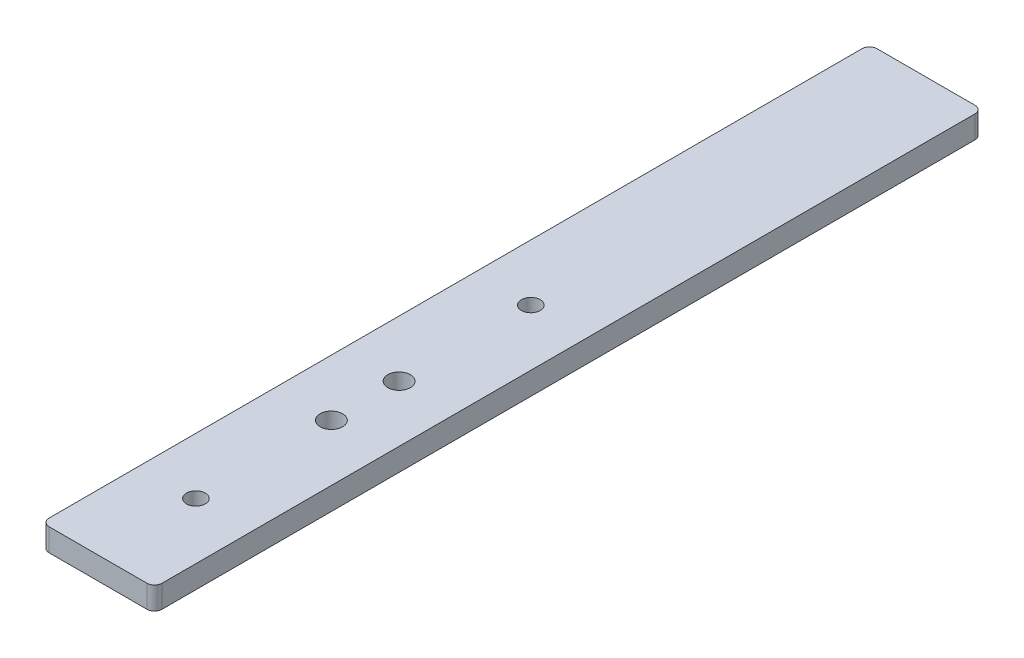
ISO-10303-21;
HEADER;
FILE_DESCRIPTION(('STEP AP214'),'2;1');
FILE_NAME('part.step','',(''),(''),'','','');
FILE_SCHEMA(('AUTOMOTIVE_DESIGN { 1 0 10303 214 1 1 1 1 }'));
ENDSEC;
DATA;
#1=APPLICATION_CONTEXT('core data for automotive mechanical design processes');
#2=APPLICATION_PROTOCOL_DEFINITION('international standard','automotive_design',2000,#1);
#3=PRODUCT_CONTEXT('',#1,'mechanical');
#4=PRODUCT('Part','Part','',(#3));
#5=PRODUCT_RELATED_PRODUCT_CATEGORY('part','',(#4));
#6=PRODUCT_DEFINITION_FORMATION('','',#4);
#7=PRODUCT_DEFINITION_CONTEXT('part definition',#1,'design');
#8=PRODUCT_DEFINITION('design','',#6,#7);
#9=PRODUCT_DEFINITION_SHAPE('','',#8);
#10=(LENGTH_UNIT() NAMED_UNIT(*) SI_UNIT(.MILLI.,.METRE.));
#11=(NAMED_UNIT(*) PLANE_ANGLE_UNIT() SI_UNIT($,.RADIAN.));
#12=(NAMED_UNIT(*) SI_UNIT($,.STERADIAN.) SOLID_ANGLE_UNIT());
#13=UNCERTAINTY_MEASURE_WITH_UNIT(LENGTH_MEASURE(1.E-05),#10,'distance_accuracy_value','');
#14=(GEOMETRIC_REPRESENTATION_CONTEXT(3) GLOBAL_UNCERTAINTY_ASSIGNED_CONTEXT((#13)) GLOBAL_UNIT_ASSIGNED_CONTEXT((#10,
#11,#12)) REPRESENTATION_CONTEXT('',''));
#15=CARTESIAN_POINT('',(0.,0.,0.));
#16=DIRECTION('',(0.,0.,1.));
#17=DIRECTION('',(1.,0.,0.));
#18=AXIS2_PLACEMENT_3D('',#15,#16,#17);
#19=CARTESIAN_POINT('',(0.,3.,0.));
#20=DIRECTION('',(1.,0.,0.));
#21=DIRECTION('',(0.,0.,-1.));
#22=AXIS2_PLACEMENT_3D('',#19,#20,#21);
#23=PLANE('',#22);
#24=DIRECTION('',(0.,0.,1.));
#25=VECTOR('',#24,1.);
#26=CARTESIAN_POINT('',(0.,3.,0.));
#27=LINE('',#26,#25);
#28=CARTESIAN_POINT('',(0.,3.,-109.));
#29=VERTEX_POINT('',#28);
#30=CARTESIAN_POINT('',(0.,3.,-1.));
#31=VERTEX_POINT('',#30);
#32=EDGE_CURVE('E127',#29,#31,#27,.T.);
#33=ORIENTED_EDGE('',*,*,#32,.F.);
#34=DIRECTION('',(0.,-1.,0.));
#35=VECTOR('',#34,1.);
#36=CARTESIAN_POINT('',(0.,3.,-109.));
#37=LINE('',#36,#35);
#38=CARTESIAN_POINT('',(0.,0.,-109.));
#39=VERTEX_POINT('',#38);
#40=EDGE_CURVE('E153',#29,#39,#37,.T.);
#41=ORIENTED_EDGE('',*,*,#40,.T.);
#42=DIRECTION('',(0.,0.,1.));
#43=VECTOR('',#42,1.);
#44=CARTESIAN_POINT('',(0.,0.,0.));
#45=LINE('',#44,#43);
#46=CARTESIAN_POINT('',(0.,0.,-1.));
#47=VERTEX_POINT('',#46);
#48=EDGE_CURVE('E175',#39,#47,#45,.T.);
#49=ORIENTED_EDGE('',*,*,#48,.T.);
#50=DIRECTION('',(0.,-1.,0.));
#51=VECTOR('',#50,1.);
#52=CARTESIAN_POINT('',(0.,3.,-1.));
#53=LINE('',#52,#51);
#54=EDGE_CURVE('E151',#47,#31,#53,.F.);
#55=ORIENTED_EDGE('',*,*,#54,.T.);
#56=EDGE_LOOP('',(#33,#41,#49,#55));
#57=FACE_BOUND('',#56,.T.);
#58=ADVANCED_FACE('F34',(#57),#23,.F.);
#59=CARTESIAN_POINT('',(0.,3.,0.));
#60=DIRECTION('',(0.,0.,-1.));
#61=DIRECTION('',(-1.,0.,0.));
#62=AXIS2_PLACEMENT_3D('',#59,#60,#61);
#63=PLANE('',#62);
#64=DIRECTION('',(1.,0.,0.));
#65=VECTOR('',#64,1.);
#66=CARTESIAN_POINT('',(0.,0.,0.));
#67=LINE('',#66,#65);
#68=CARTESIAN_POINT('',(1.,0.,0.));
#69=VERTEX_POINT('',#68);
#70=CARTESIAN_POINT('',(14.,0.,0.));
#71=VERTEX_POINT('',#70);
#72=EDGE_CURVE('E132',#69,#71,#67,.T.);
#73=ORIENTED_EDGE('',*,*,#72,.T.);
#74=DIRECTION('',(0.,-1.,0.));
#75=VECTOR('',#74,1.);
#76=CARTESIAN_POINT('',(14.,3.,0.));
#77=LINE('',#76,#75);
#78=CARTESIAN_POINT('',(14.,3.,0.));
#79=VERTEX_POINT('',#78);
#80=EDGE_CURVE('E11',#71,#79,#77,.F.);
#81=ORIENTED_EDGE('',*,*,#80,.T.);
#82=DIRECTION('',(1.,0.,0.));
#83=VECTOR('',#82,1.);
#84=CARTESIAN_POINT('',(0.,3.,0.));
#85=LINE('',#84,#83);
#86=CARTESIAN_POINT('',(1.,3.,0.));
#87=VERTEX_POINT('',#86);
#88=EDGE_CURVE('E130',#87,#79,#85,.T.);
#89=ORIENTED_EDGE('',*,*,#88,.F.);
#90=DIRECTION('',(0.,-1.,0.));
#91=VECTOR('',#90,1.);
#92=CARTESIAN_POINT('',(1.,3.,0.));
#93=LINE('',#92,#91);
#94=EDGE_CURVE('E43',#87,#69,#93,.T.);
#95=ORIENTED_EDGE('',*,*,#94,.T.);
#96=EDGE_LOOP('',(#73,#81,#89,#95));
#97=FACE_BOUND('',#96,.T.);
#98=ADVANCED_FACE('F191',(#97),#63,.F.);
#99=CARTESIAN_POINT('',(15.,3.,0.));
#100=DIRECTION('',(-1.,0.,0.));
#101=DIRECTION('',(0.,0.,1.));
#102=AXIS2_PLACEMENT_3D('',#99,#100,#101);
#103=PLANE('',#102);
#104=DIRECTION('',(0.,0.,-1.));
#105=VECTOR('',#104,1.);
#106=CARTESIAN_POINT('',(15.,0.,0.));
#107=LINE('',#106,#105);
#108=CARTESIAN_POINT('',(15.,0.,-1.));
#109=VERTEX_POINT('',#108);
#110=CARTESIAN_POINT('',(15.,0.,-109.));
#111=VERTEX_POINT('',#110);
#112=EDGE_CURVE('E128',#109,#111,#107,.T.);
#113=ORIENTED_EDGE('',*,*,#112,.T.);
#114=DIRECTION('',(0.,-1.,0.));
#115=VECTOR('',#114,1.);
#116=CARTESIAN_POINT('',(15.,3.,-109.));
#117=LINE('',#116,#115);
#118=CARTESIAN_POINT('',(15.,3.,-109.));
#119=VERTEX_POINT('',#118);
#120=EDGE_CURVE('E106',#111,#119,#117,.F.);
#121=ORIENTED_EDGE('',*,*,#120,.T.);
#122=DIRECTION('',(0.,0.,-1.));
#123=VECTOR('',#122,1.);
#124=CARTESIAN_POINT('',(15.,3.,0.));
#125=LINE('',#124,#123);
#126=CARTESIAN_POINT('',(15.,3.,-1.));
#127=VERTEX_POINT('',#126);
#128=EDGE_CURVE('E185',#127,#119,#125,.T.);
#129=ORIENTED_EDGE('',*,*,#128,.F.);
#130=DIRECTION('',(0.,-1.,0.));
#131=VECTOR('',#130,1.);
#132=CARTESIAN_POINT('',(15.,3.,-1.));
#133=LINE('',#132,#131);
#134=EDGE_CURVE('E111',#127,#109,#133,.T.);
#135=ORIENTED_EDGE('',*,*,#134,.T.);
#136=EDGE_LOOP('',(#113,#121,#129,#135));
#137=FACE_BOUND('',#136,.T.);
#138=ADVANCED_FACE('F200',(#137),#103,.F.);
#139=CARTESIAN_POINT('',(0.,3.,-110.));
#140=DIRECTION('',(0.,0.,1.));
#141=DIRECTION('',(1.,0.,0.));
#142=AXIS2_PLACEMENT_3D('',#139,#140,#141);
#143=PLANE('',#142);
#144=DIRECTION('',(-1.,0.,0.));
#145=VECTOR('',#144,1.);
#146=CARTESIAN_POINT('',(0.,3.,-110.));
#147=LINE('',#146,#145);
#148=CARTESIAN_POINT('',(14.,3.,-110.));
#149=VERTEX_POINT('',#148);
#150=CARTESIAN_POINT('',(1.,3.,-110.));
#151=VERTEX_POINT('',#150);
#152=EDGE_CURVE('E121',#149,#151,#147,.T.);
#153=ORIENTED_EDGE('',*,*,#152,.F.);
#154=DIRECTION('',(0.,-1.,0.));
#155=VECTOR('',#154,1.);
#156=CARTESIAN_POINT('',(14.,3.,-110.));
#157=LINE('',#156,#155);
#158=CARTESIAN_POINT('',(14.,0.,-110.));
#159=VERTEX_POINT('',#158);
#160=EDGE_CURVE('E105',#149,#159,#157,.T.);
#161=ORIENTED_EDGE('',*,*,#160,.T.);
#162=DIRECTION('',(-1.,0.,0.));
#163=VECTOR('',#162,1.);
#164=CARTESIAN_POINT('',(0.,0.,-110.));
#165=LINE('',#164,#163);
#166=CARTESIAN_POINT('',(1.,0.,-110.));
#167=VERTEX_POINT('',#166);
#168=EDGE_CURVE('E118',#159,#167,#165,.T.);
#169=ORIENTED_EDGE('',*,*,#168,.T.);
#170=DIRECTION('',(0.,-1.,0.));
#171=VECTOR('',#170,1.);
#172=CARTESIAN_POINT('',(1.,3.,-110.));
#173=LINE('',#172,#171);
#174=EDGE_CURVE('E123',#167,#151,#173,.F.);
#175=ORIENTED_EDGE('',*,*,#174,.T.);
#176=EDGE_LOOP('',(#153,#161,#169,#175));
#177=FACE_BOUND('',#176,.T.);
#178=ADVANCED_FACE('F117',(#177),#143,.F.);
#179=CARTESIAN_POINT('',(0.,3.,0.));
#180=DIRECTION('',(0.,-1.,0.));
#181=DIRECTION('',(0.,0.,-1.));
#182=AXIS2_PLACEMENT_3D('',#179,#180,#181);
#183=PLANE('',#182);
#184=CARTESIAN_POINT('',(7.5,3.,-40.));
#185=DIRECTION('',(0.,1.,0.));
#186=DIRECTION('',(0.,0.,1.));
#187=AXIS2_PLACEMENT_3D('',#184,#185,#186);
#188=CIRCLE('',#187,1.5);
#189=CARTESIAN_POINT('',(7.5,3.,-38.5));
#190=VERTEX_POINT('',#189);
#191=EDGE_CURVE('E159',#190,#190,#188,.T.);
#192=ORIENTED_EDGE('',*,*,#191,.F.);
#193=EDGE_LOOP('',(#192));
#194=FACE_BOUND('',#193,.T.);
#195=CARTESIAN_POINT('',(7.5,3.,-31.));
#196=DIRECTION('',(0.,1.,0.));
#197=DIRECTION('',(0.,0.,1.));
#198=AXIS2_PLACEMENT_3D('',#195,#196,#197);
#199=CIRCLE('',#198,1.5);
#200=CARTESIAN_POINT('',(7.5,3.,-29.5));
#201=VERTEX_POINT('',#200);
#202=EDGE_CURVE('E165',#201,#201,#199,.T.);
#203=ORIENTED_EDGE('',*,*,#202,.F.);
#204=EDGE_LOOP('',(#203));
#205=FACE_BOUND('',#204,.T.);
#206=CARTESIAN_POINT('',(7.5,3.,-13.));
#207=DIRECTION('',(0.,1.,0.));
#208=DIRECTION('',(0.,0.,1.));
#209=AXIS2_PLACEMENT_3D('',#206,#207,#208);
#210=CIRCLE('',#209,1.25);
#211=CARTESIAN_POINT('',(7.5,3.,-11.75));
#212=VERTEX_POINT('',#211);
#213=EDGE_CURVE('E176',#212,#212,#210,.T.);
#214=ORIENTED_EDGE('',*,*,#213,.F.);
#215=EDGE_LOOP('',(#214));
#216=FACE_BOUND('',#215,.T.);
#217=CARTESIAN_POINT('',(7.5,3.,-57.5));
#218=DIRECTION('',(0.,1.,0.));
#219=DIRECTION('',(0.,0.,1.));
#220=AXIS2_PLACEMENT_3D('',#217,#218,#219);
#221=CIRCLE('',#220,1.25);
#222=CARTESIAN_POINT('',(7.5,3.,-56.25));
#223=VERTEX_POINT('',#222);
#224=EDGE_CURVE('E163',#223,#223,#221,.T.);
#225=ORIENTED_EDGE('',*,*,#224,.F.);
#226=EDGE_LOOP('',(#225));
#227=FACE_BOUND('',#226,.T.);
#228=ORIENTED_EDGE('',*,*,#128,.T.);
#229=CARTESIAN_POINT('',(14.,3.,-109.));
#230=DIRECTION('',(0.,-1.,0.));
#231=DIRECTION('',(0.,0.,-1.));
#232=AXIS2_PLACEMENT_3D('',#229,#230,#231);
#233=CIRCLE('',#232,1.);
#234=EDGE_CURVE('E149',#119,#149,#233,.F.);
#235=ORIENTED_EDGE('',*,*,#234,.T.);
#236=ORIENTED_EDGE('',*,*,#152,.T.);
#237=CARTESIAN_POINT('',(1.,3.,-109.));
#238=DIRECTION('',(0.,-1.,0.));
#239=DIRECTION('',(0.,0.,-1.));
#240=AXIS2_PLACEMENT_3D('',#237,#238,#239);
#241=CIRCLE('',#240,1.);
#242=EDGE_CURVE('E147',#151,#29,#241,.F.);
#243=ORIENTED_EDGE('',*,*,#242,.T.);
#244=ORIENTED_EDGE('',*,*,#32,.T.);
#245=CARTESIAN_POINT('',(1.,3.,-1.));
#246=DIRECTION('',(0.,-1.,0.));
#247=DIRECTION('',(0.,0.,-1.));
#248=AXIS2_PLACEMENT_3D('',#245,#246,#247);
#249=CIRCLE('',#248,1.);
#250=EDGE_CURVE('E56',#31,#87,#249,.F.);
#251=ORIENTED_EDGE('',*,*,#250,.T.);
#252=ORIENTED_EDGE('',*,*,#88,.T.);
#253=CARTESIAN_POINT('',(14.,3.,-1.));
#254=DIRECTION('',(0.,-1.,0.));
#255=DIRECTION('',(0.,0.,-1.));
#256=AXIS2_PLACEMENT_3D('',#253,#254,#255);
#257=CIRCLE('',#256,1.);
#258=EDGE_CURVE('E145',#79,#127,#257,.F.);
#259=ORIENTED_EDGE('',*,*,#258,.T.);
#260=EDGE_LOOP('',(#228,#235,#236,#243,#244,#251,#252,#259));
#261=FACE_BOUND('',#260,.T.);
#262=ADVANCED_FACE('F198',(#194,#205,#216,#227,#261),#183,.F.);
#263=CARTESIAN_POINT('',(0.,0.,0.));
#264=DIRECTION('',(0.,-1.,0.));
#265=DIRECTION('',(0.,0.,-1.));
#266=AXIS2_PLACEMENT_3D('',#263,#264,#265);
#267=PLANE('',#266);
#268=CARTESIAN_POINT('',(7.5,0.,-40.));
#269=DIRECTION('',(0.,-1.,0.));
#270=DIRECTION('',(0.,0.,-1.));
#271=AXIS2_PLACEMENT_3D('',#268,#269,#270);
#272=CIRCLE('',#271,1.5);
#273=CARTESIAN_POINT('',(7.5,0.,-41.5));
#274=VERTEX_POINT('',#273);
#275=EDGE_CURVE('E38',#274,#274,#272,.T.);
#276=ORIENTED_EDGE('',*,*,#275,.F.);
#277=EDGE_LOOP('',(#276));
#278=FACE_BOUND('',#277,.T.);
#279=CARTESIAN_POINT('',(7.5,0.,-31.));
#280=DIRECTION('',(0.,-1.,0.));
#281=DIRECTION('',(0.,0.,-1.));
#282=AXIS2_PLACEMENT_3D('',#279,#280,#281);
#283=CIRCLE('',#282,1.5);
#284=CARTESIAN_POINT('',(7.5,0.,-32.5));
#285=VERTEX_POINT('',#284);
#286=EDGE_CURVE('E157',#285,#285,#283,.T.);
#287=ORIENTED_EDGE('',*,*,#286,.F.);
#288=EDGE_LOOP('',(#287));
#289=FACE_BOUND('',#288,.T.);
#290=CARTESIAN_POINT('',(7.5,0.,-13.));
#291=DIRECTION('',(0.,1.,0.));
#292=DIRECTION('',(0.,0.,1.));
#293=AXIS2_PLACEMENT_3D('',#290,#291,#292);
#294=CIRCLE('',#293,1.25);
#295=CARTESIAN_POINT('',(7.5,0.,-11.75));
#296=VERTEX_POINT('',#295);
#297=EDGE_CURVE('E172',#296,#296,#294,.T.);
#298=ORIENTED_EDGE('',*,*,#297,.T.);
#299=EDGE_LOOP('',(#298));
#300=FACE_BOUND('',#299,.T.);
#301=CARTESIAN_POINT('',(7.5,0.,-57.5));
#302=DIRECTION('',(0.,1.,0.));
#303=DIRECTION('',(0.,0.,1.));
#304=AXIS2_PLACEMENT_3D('',#301,#302,#303);
#305=CIRCLE('',#304,1.25);
#306=CARTESIAN_POINT('',(7.5,0.,-56.25));
#307=VERTEX_POINT('',#306);
#308=EDGE_CURVE('E179',#307,#307,#305,.T.);
#309=ORIENTED_EDGE('',*,*,#308,.T.);
#310=EDGE_LOOP('',(#309));
#311=FACE_BOUND('',#310,.T.);
#312=ORIENTED_EDGE('',*,*,#168,.F.);
#313=CARTESIAN_POINT('',(14.,0.,-109.));
#314=DIRECTION('',(0.,-1.,0.));
#315=DIRECTION('',(0.,0.,-1.));
#316=AXIS2_PLACEMENT_3D('',#313,#314,#315);
#317=CIRCLE('',#316,1.);
#318=EDGE_CURVE('E101',#159,#111,#317,.T.);
#319=ORIENTED_EDGE('',*,*,#318,.T.);
#320=ORIENTED_EDGE('',*,*,#112,.F.);
#321=CARTESIAN_POINT('',(14.,0.,-1.));
#322=DIRECTION('',(0.,-1.,0.));
#323=DIRECTION('',(0.,0.,-1.));
#324=AXIS2_PLACEMENT_3D('',#321,#322,#323);
#325=CIRCLE('',#324,1.);
#326=EDGE_CURVE('E138',#109,#71,#325,.T.);
#327=ORIENTED_EDGE('',*,*,#326,.T.);
#328=ORIENTED_EDGE('',*,*,#72,.F.);
#329=CARTESIAN_POINT('',(1.,0.,-1.));
#330=DIRECTION('',(0.,-1.,0.));
#331=DIRECTION('',(0.,0.,-1.));
#332=AXIS2_PLACEMENT_3D('',#329,#330,#331);
#333=CIRCLE('',#332,1.);
#334=EDGE_CURVE('E122',#69,#47,#333,.T.);
#335=ORIENTED_EDGE('',*,*,#334,.T.);
#336=ORIENTED_EDGE('',*,*,#48,.F.);
#337=CARTESIAN_POINT('',(1.,0.,-109.));
#338=DIRECTION('',(0.,-1.,0.));
#339=DIRECTION('',(0.,0.,-1.));
#340=AXIS2_PLACEMENT_3D('',#337,#338,#339);
#341=CIRCLE('',#340,1.);
#342=EDGE_CURVE('E112',#39,#167,#341,.T.);
#343=ORIENTED_EDGE('',*,*,#342,.T.);
#344=EDGE_LOOP('',(#312,#319,#320,#327,#328,#335,#336,#343));
#345=FACE_BOUND('',#344,.T.);
#346=ADVANCED_FACE('F125',(#278,#289,#300,#311,#345),#267,.T.);
#347=CARTESIAN_POINT('',(14.,3.,-109.));
#348=DIRECTION('',(0.,-1.,0.));
#349=DIRECTION('',(0.,0.,-1.));
#350=AXIS2_PLACEMENT_3D('',#347,#348,#349);
#351=CYLINDRICAL_SURFACE('',#350,1.);
#352=ORIENTED_EDGE('',*,*,#234,.F.);
#353=ORIENTED_EDGE('',*,*,#120,.F.);
#354=ORIENTED_EDGE('',*,*,#318,.F.);
#355=ORIENTED_EDGE('',*,*,#160,.F.);
#356=EDGE_LOOP('',(#352,#353,#354,#355));
#357=FACE_BOUND('',#356,.T.);
#358=ADVANCED_FACE('F104',(#357),#351,.T.);
#359=CARTESIAN_POINT('',(1.,3.,-109.));
#360=DIRECTION('',(0.,-1.,0.));
#361=DIRECTION('',(0.,0.,-1.));
#362=AXIS2_PLACEMENT_3D('',#359,#360,#361);
#363=CYLINDRICAL_SURFACE('',#362,1.);
#364=ORIENTED_EDGE('',*,*,#242,.F.);
#365=ORIENTED_EDGE('',*,*,#174,.F.);
#366=ORIENTED_EDGE('',*,*,#342,.F.);
#367=ORIENTED_EDGE('',*,*,#40,.F.);
#368=EDGE_LOOP('',(#364,#365,#366,#367));
#369=FACE_BOUND('',#368,.T.);
#370=ADVANCED_FACE('F218',(#369),#363,.T.);
#371=CARTESIAN_POINT('',(14.,3.,-1.));
#372=DIRECTION('',(0.,-1.,0.));
#373=DIRECTION('',(0.,0.,-1.));
#374=AXIS2_PLACEMENT_3D('',#371,#372,#373);
#375=CYLINDRICAL_SURFACE('',#374,1.);
#376=ORIENTED_EDGE('',*,*,#258,.F.);
#377=ORIENTED_EDGE('',*,*,#80,.F.);
#378=ORIENTED_EDGE('',*,*,#326,.F.);
#379=ORIENTED_EDGE('',*,*,#134,.F.);
#380=EDGE_LOOP('',(#376,#377,#378,#379));
#381=FACE_BOUND('',#380,.T.);
#382=ADVANCED_FACE('F195',(#381),#375,.T.);
#383=CARTESIAN_POINT('',(1.,3.,-1.));
#384=DIRECTION('',(0.,-1.,0.));
#385=DIRECTION('',(0.,0.,-1.));
#386=AXIS2_PLACEMENT_3D('',#383,#384,#385);
#387=CYLINDRICAL_SURFACE('',#386,1.);
#388=ORIENTED_EDGE('',*,*,#250,.F.);
#389=ORIENTED_EDGE('',*,*,#54,.F.);
#390=ORIENTED_EDGE('',*,*,#334,.F.);
#391=ORIENTED_EDGE('',*,*,#94,.F.);
#392=EDGE_LOOP('',(#388,#389,#390,#391));
#393=FACE_BOUND('',#392,.T.);
#394=ADVANCED_FACE('F36',(#393),#387,.T.);
#395=CARTESIAN_POINT('',(7.5,0.,-57.5));
#396=DIRECTION('',(0.,1.,0.));
#397=DIRECTION('',(0.,0.,1.));
#398=AXIS2_PLACEMENT_3D('',#395,#396,#397);
#399=CYLINDRICAL_SURFACE('',#398,1.25);
#400=ORIENTED_EDGE('',*,*,#308,.F.);
#401=EDGE_LOOP('',(#400));
#402=FACE_BOUND('',#401,.T.);
#403=ORIENTED_EDGE('',*,*,#224,.T.);
#404=EDGE_LOOP('',(#403));
#405=FACE_BOUND('',#404,.T.);
#406=ADVANCED_FACE('F225',(#402,#405),#399,.F.);
#407=CARTESIAN_POINT('',(7.5,0.,-13.));
#408=DIRECTION('',(0.,1.,0.));
#409=DIRECTION('',(0.,0.,1.));
#410=AXIS2_PLACEMENT_3D('',#407,#408,#409);
#411=CYLINDRICAL_SURFACE('',#410,1.25);
#412=ORIENTED_EDGE('',*,*,#297,.F.);
#413=EDGE_LOOP('',(#412));
#414=FACE_BOUND('',#413,.T.);
#415=ORIENTED_EDGE('',*,*,#213,.T.);
#416=EDGE_LOOP('',(#415));
#417=FACE_BOUND('',#416,.T.);
#418=ADVANCED_FACE('F230',(#414,#417),#411,.F.);
#419=CARTESIAN_POINT('',(7.5,-7.,-31.));
#420=DIRECTION('',(0.,1.,0.));
#421=DIRECTION('',(0.,0.,1.));
#422=AXIS2_PLACEMENT_3D('',#419,#420,#421);
#423=CYLINDRICAL_SURFACE('',#422,1.5);
#424=ORIENTED_EDGE('',*,*,#286,.T.);
#425=EDGE_LOOP('',(#424));
#426=FACE_BOUND('',#425,.T.);
#427=ORIENTED_EDGE('',*,*,#202,.T.);
#428=EDGE_LOOP('',(#427));
#429=FACE_BOUND('',#428,.T.);
#430=ADVANCED_FACE('F239',(#426,#429),#423,.F.);
#431=CARTESIAN_POINT('',(7.5,-7.,-40.));
#432=DIRECTION('',(0.,1.,0.));
#433=DIRECTION('',(0.,0.,1.));
#434=AXIS2_PLACEMENT_3D('',#431,#432,#433);
#435=CYLINDRICAL_SURFACE('',#434,1.5);
#436=ORIENTED_EDGE('',*,*,#275,.T.);
#437=EDGE_LOOP('',(#436));
#438=FACE_BOUND('',#437,.T.);
#439=ORIENTED_EDGE('',*,*,#191,.T.);
#440=EDGE_LOOP('',(#439));
#441=FACE_BOUND('',#440,.T.);
#442=ADVANCED_FACE('F264',(#438,#441),#435,.F.);
#443=CLOSED_SHELL('',(#58,#98,#138,#178,#262,#346,#358,#370,#382,#394,#406,#418,#430,#442));
#444=MANIFOLD_SOLID_BREP('B2',#443);
#445=ADVANCED_BREP_SHAPE_REPRESENTATION('',(#18,#444),#14);
#446=SHAPE_DEFINITION_REPRESENTATION(#9,#445);
ENDSEC;
END-ISO-10303-21;
